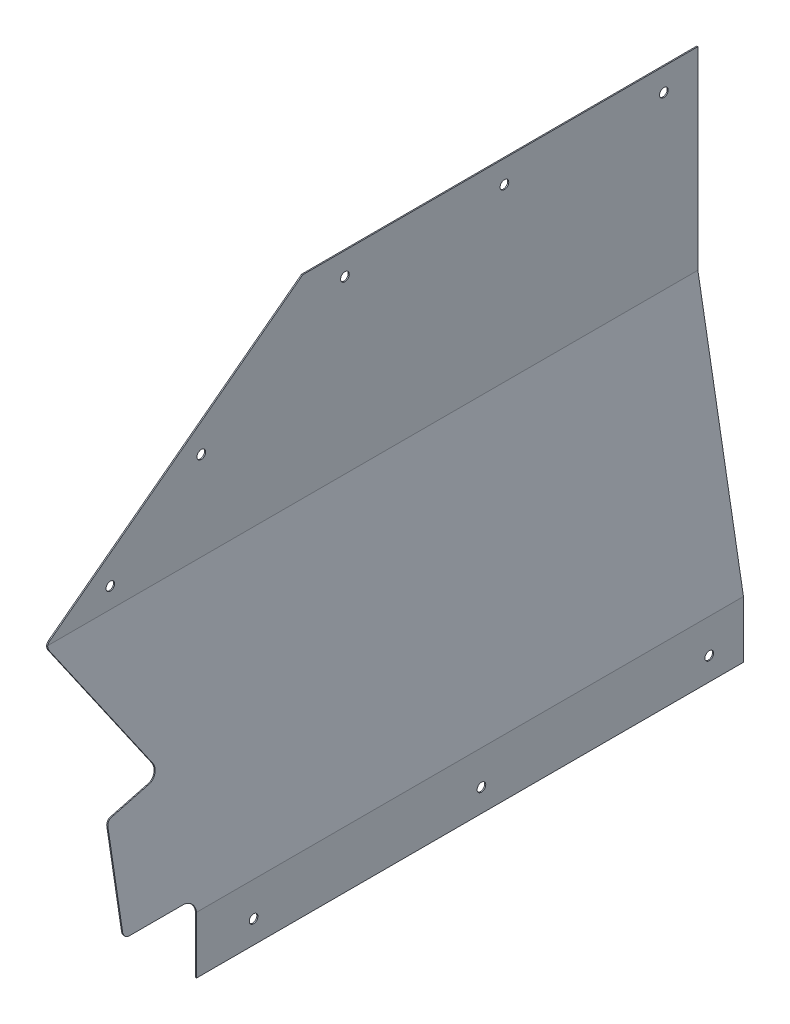
ISO-10303-21;
HEADER;
FILE_DESCRIPTION(('STEP AP214'),'2;1');
FILE_NAME('part.step','',(''),(''),'','','');
FILE_SCHEMA(('AUTOMOTIVE_DESIGN { 1 0 10303 214 1 1 1 1 }'));
ENDSEC;
DATA;
#1=APPLICATION_CONTEXT('core data for automotive mechanical design processes');
#2=APPLICATION_PROTOCOL_DEFINITION('international standard','automotive_design',2000,#1);
#3=PRODUCT_CONTEXT('',#1,'mechanical');
#4=PRODUCT('Part','Part','',(#3));
#5=PRODUCT_RELATED_PRODUCT_CATEGORY('part','',(#4));
#6=PRODUCT_DEFINITION_FORMATION('','',#4);
#7=PRODUCT_DEFINITION_CONTEXT('part definition',#1,'design');
#8=PRODUCT_DEFINITION('design','',#6,#7);
#9=PRODUCT_DEFINITION_SHAPE('','',#8);
#10=(LENGTH_UNIT() NAMED_UNIT(*) SI_UNIT(.MILLI.,.METRE.));
#11=(NAMED_UNIT(*) PLANE_ANGLE_UNIT() SI_UNIT($,.RADIAN.));
#12=(NAMED_UNIT(*) SI_UNIT($,.STERADIAN.) SOLID_ANGLE_UNIT());
#13=UNCERTAINTY_MEASURE_WITH_UNIT(LENGTH_MEASURE(1.E-05),#10,'distance_accuracy_value','');
#14=(GEOMETRIC_REPRESENTATION_CONTEXT(3) GLOBAL_UNCERTAINTY_ASSIGNED_CONTEXT((#13)) GLOBAL_UNIT_ASSIGNED_CONTEXT((#10,
#11,#12)) REPRESENTATION_CONTEXT('',''));
#15=CARTESIAN_POINT('',(0.,0.,0.));
#16=DIRECTION('',(0.,0.,1.));
#17=DIRECTION('',(1.,0.,0.));
#18=AXIS2_PLACEMENT_3D('',#15,#16,#17);
#19=CARTESIAN_POINT('',(266.7,5923.28000062489,3055.84367308646));
#20=DIRECTION('',(0.,-0.798635510047341,-0.601815023151985));
#21=DIRECTION('',(0.,0.601815023151985,-0.798635510047341));
#22=AXIS2_PLACEMENT_3D('',#19,#20,#21);
#23=PLANE('',#22);
#24=DIRECTION('',(0.,0.601815023151988,-0.798635510047338));
#25=VECTOR('',#24,1.);
#26=CARTESIAN_POINT('',(266.700000000003,5874.23441641765,3120.92936163202));
#27=LINE('',#26,#25);
#28=CARTESIAN_POINT('',(266.700000000003,5874.23441641766,3120.92936163202));
#29=VERTEX_POINT('',#28);
#30=CARTESIAN_POINT('',(266.699999999999,5980.43000062489,2980.00306153083));
#31=VERTEX_POINT('',#30);
#32=EDGE_CURVE('E248',#29,#31,#27,.T.);
#33=ORIENTED_EDGE('',*,*,#32,.T.);
#34=DIRECTION('',(1.,0.,0.));
#35=VECTOR('',#34,1.);
#36=CARTESIAN_POINT('',(266.7,5980.43000062489,2980.00306153083));
#37=LINE('',#36,#35);
#38=CARTESIAN_POINT('',(266.090399999999,5980.43000062489,2980.00306153083));
#39=VERTEX_POINT('',#38);
#40=EDGE_CURVE('E258',#31,#39,#37,.F.);
#41=ORIENTED_EDGE('',*,*,#40,.T.);
#42=DIRECTION('',(0.,0.601815023151969,-0.798635510047353));
#43=VECTOR('',#42,1.);
#44=CARTESIAN_POINT('',(266.090400000003,5874.20031726228,3120.97461273959));
#45=LINE('',#44,#43);
#46=CARTESIAN_POINT('',(266.090400000003,5874.20031726227,3120.9746127396));
#47=VERTEX_POINT('',#46);
#48=EDGE_CURVE('E245',#47,#39,#45,.T.);
#49=ORIENTED_EDGE('',*,*,#48,.F.);
#50=DIRECTION('',(-0.995708210528336,-0.0556968651427743,0.0739122364681644));
#51=VECTOR('',#50,1.);
#52=CARTESIAN_POINT('',(273.348331735291,5874.60630371574,3120.43585051889));
#53=LINE('',#52,#51);
#54=EDGE_CURVE('E175',#29,#47,#53,.T.);
#55=ORIENTED_EDGE('',*,*,#54,.F.);
#56=EDGE_LOOP('',(#33,#41,#49,#55));
#57=FACE_BOUND('',#56,.T.);
#58=ADVANCED_FACE('F42',(#57),#23,.F.);
#59=CARTESIAN_POINT('',(266.7,5980.43000062489,2874.06989807406));
#60=DIRECTION('',(0.,-1.,0.));
#61=DIRECTION('',(1.,0.,0.));
#62=AXIS2_PLACEMENT_3D('',#59,#60,#61);
#63=PLANE('',#62);
#64=DIRECTION('',(1.,0.,0.));
#65=VECTOR('',#64,1.);
#66=CARTESIAN_POINT('',(266.7,5980.43000062489,2759.71));
#67=LINE('',#66,#65);
#68=CARTESIAN_POINT('',(266.0904,5980.43000062489,2759.71));
#69=VERTEX_POINT('',#68);
#70=CARTESIAN_POINT('',(266.7,5980.43000062489,2759.71));
#71=VERTEX_POINT('',#70);
#72=EDGE_CURVE('E253',#69,#71,#67,.T.);
#73=ORIENTED_EDGE('',*,*,#72,.F.);
#74=DIRECTION('',(0.,0.,1.));
#75=VECTOR('',#74,1.);
#76=CARTESIAN_POINT('',(266.0904,5980.43000062489,2759.71));
#77=LINE('',#76,#75);
#78=EDGE_CURVE('E241',#39,#69,#77,.F.);
#79=ORIENTED_EDGE('',*,*,#78,.F.);
#80=ORIENTED_EDGE('',*,*,#40,.F.);
#81=DIRECTION('',(0.,0.,1.));
#82=VECTOR('',#81,1.);
#83=CARTESIAN_POINT('',(266.7,5980.43000062489,2759.71));
#84=LINE('',#83,#82);
#85=EDGE_CURVE('E252',#31,#71,#84,.F.);
#86=ORIENTED_EDGE('',*,*,#85,.T.);
#87=EDGE_LOOP('',(#73,#79,#80,#86));
#88=FACE_BOUND('',#87,.T.);
#89=ADVANCED_FACE('F373',(#88),#63,.F.);
#90=CARTESIAN_POINT('',(266.090400000003,5883.74292329504,3087.20831702677));
#91=DIRECTION('',(1.,0.,0.));
#92=DIRECTION('',(0.,1.,0.));
#93=AXIS2_PLACEMENT_3D('',#90,#91,#92);
#94=CYLINDRICAL_SURFACE('',#93,2.41300000000024);
#95=CARTESIAN_POINT('',(266.090400000003,5883.74292329504,3087.20831702677));
#96=DIRECTION('',(1.,0.,0.));
#97=DIRECTION('',(0.,1.,0.));
#98=AXIS2_PLACEMENT_3D('',#95,#96,#97);
#99=CIRCLE('',#98,2.41300000000024);
#100=CARTESIAN_POINT('',(266.090400000003,5886.15592329504,3087.20831702677));
#101=VERTEX_POINT('',#100);
#102=EDGE_CURVE('E244',#101,#101,#99,.T.);
#103=ORIENTED_EDGE('',*,*,#102,.F.);
#104=EDGE_LOOP('',(#103));
#105=FACE_BOUND('',#104,.T.);
#106=CARTESIAN_POINT('',(266.700000000003,5883.74292329504,3087.20831702677));
#107=DIRECTION('',(1.,0.,0.));
#108=DIRECTION('',(0.,1.,0.));
#109=AXIS2_PLACEMENT_3D('',#106,#107,#108);
#110=CIRCLE('',#109,2.41300000000024);
#111=CARTESIAN_POINT('',(266.700000000002,5886.15592329504,3087.20831702677));
#112=VERTEX_POINT('',#111);
#113=EDGE_CURVE('E45',#112,#112,#110,.T.);
#114=ORIENTED_EDGE('',*,*,#113,.T.);
#115=EDGE_LOOP('',(#114));
#116=FACE_BOUND('',#115,.T.);
#117=ADVANCED_FACE('F370',(#105,#116),#94,.F.);
#118=CARTESIAN_POINT('',(266.090400000003,5921.95817726519,3036.49496213877));
#119=DIRECTION('',(1.,0.,0.));
#120=DIRECTION('',(0.,1.,0.));
#121=AXIS2_PLACEMENT_3D('',#118,#119,#120);
#122=CYLINDRICAL_SURFACE('',#121,2.41300000000024);
#123=CARTESIAN_POINT('',(266.0904,5921.95817726519,3036.49496213877));
#124=DIRECTION('',(1.,0.,0.));
#125=DIRECTION('',(0.,1.,0.));
#126=AXIS2_PLACEMENT_3D('',#123,#124,#125);
#127=CIRCLE('',#126,2.41300000000024);
#128=CARTESIAN_POINT('',(266.0904,5924.37117726519,3036.49496213877));
#129=VERTEX_POINT('',#128);
#130=EDGE_CURVE('E558',#129,#129,#127,.T.);
#131=ORIENTED_EDGE('',*,*,#130,.F.);
#132=EDGE_LOOP('',(#131));
#133=FACE_BOUND('',#132,.T.);
#134=CARTESIAN_POINT('',(266.700000000003,5921.95817726519,3036.49496213877));
#135=DIRECTION('',(1.,0.,0.));
#136=DIRECTION('',(0.,1.,0.));
#137=AXIS2_PLACEMENT_3D('',#134,#135,#136);
#138=CIRCLE('',#137,2.41300000000024);
#139=CARTESIAN_POINT('',(266.700000000002,5924.37117726519,3036.49496213877));
#140=VERTEX_POINT('',#139);
#141=EDGE_CURVE('E457',#140,#140,#138,.T.);
#142=ORIENTED_EDGE('',*,*,#141,.T.);
#143=EDGE_LOOP('',(#142));
#144=FACE_BOUND('',#143,.T.);
#145=ADVANCED_FACE('F366',(#133,#144),#122,.F.);
#146=CARTESIAN_POINT('',(266.0904,5967.73000051653,2956.44607591665));
#147=DIRECTION('',(1.,0.,0.));
#148=DIRECTION('',(0.,1.,0.));
#149=AXIS2_PLACEMENT_3D('',#146,#147,#148);
#150=CYLINDRICAL_SURFACE('',#149,2.41300000000024);
#151=CARTESIAN_POINT('',(266.0904,5967.73000051653,2956.44607591665));
#152=DIRECTION('',(1.,0.,0.));
#153=DIRECTION('',(0.,1.,0.));
#154=AXIS2_PLACEMENT_3D('',#151,#152,#153);
#155=CIRCLE('',#154,2.41300000000024);
#156=CARTESIAN_POINT('',(266.0904,5970.14300051653,2956.44607591665));
#157=VERTEX_POINT('',#156);
#158=EDGE_CURVE('E556',#157,#157,#155,.T.);
#159=ORIENTED_EDGE('',*,*,#158,.F.);
#160=EDGE_LOOP('',(#159));
#161=FACE_BOUND('',#160,.T.);
#162=CARTESIAN_POINT('',(266.7,5967.73000051653,2956.44607591665));
#163=DIRECTION('',(1.,0.,0.));
#164=DIRECTION('',(0.,1.,0.));
#165=AXIS2_PLACEMENT_3D('',#162,#163,#164);
#166=CIRCLE('',#165,2.41300000000024);
#167=CARTESIAN_POINT('',(266.7,5970.14300051653,2956.44607591665));
#168=VERTEX_POINT('',#167);
#169=EDGE_CURVE('E234',#168,#168,#166,.T.);
#170=ORIENTED_EDGE('',*,*,#169,.T.);
#171=EDGE_LOOP('',(#170));
#172=FACE_BOUND('',#171,.T.);
#173=ADVANCED_FACE('F362',(#161,#172),#150,.F.);
#174=CARTESIAN_POINT('',(266.0904,5967.73000018003,2778.64607591665));
#175=DIRECTION('',(1.,0.,0.));
#176=DIRECTION('',(0.,1.,0.));
#177=AXIS2_PLACEMENT_3D('',#174,#175,#176);
#178=CYLINDRICAL_SURFACE('',#177,2.41300000000024);
#179=CARTESIAN_POINT('',(266.0904,5967.73000018003,2778.64607591665));
#180=DIRECTION('',(1.,0.,0.));
#181=DIRECTION('',(0.,1.,0.));
#182=AXIS2_PLACEMENT_3D('',#179,#180,#181);
#183=CIRCLE('',#182,2.41300000000024);
#184=CARTESIAN_POINT('',(266.0904,5970.14300018004,2778.64607591665));
#185=VERTEX_POINT('',#184);
#186=EDGE_CURVE('E553',#185,#185,#183,.T.);
#187=ORIENTED_EDGE('',*,*,#186,.F.);
#188=EDGE_LOOP('',(#187));
#189=FACE_BOUND('',#188,.T.);
#190=CARTESIAN_POINT('',(266.7,5967.73000018003,2778.64607591665));
#191=DIRECTION('',(1.,0.,0.));
#192=DIRECTION('',(0.,1.,0.));
#193=AXIS2_PLACEMENT_3D('',#190,#191,#192);
#194=CIRCLE('',#193,2.41300000000024);
#195=CARTESIAN_POINT('',(266.7,5970.14300018004,2778.64607591665));
#196=VERTEX_POINT('',#195);
#197=EDGE_CURVE('E452',#196,#196,#194,.T.);
#198=ORIENTED_EDGE('',*,*,#197,.T.);
#199=EDGE_LOOP('',(#198));
#200=FACE_BOUND('',#199,.T.);
#201=ADVANCED_FACE('F358',(#189,#200),#178,.F.);
#202=CARTESIAN_POINT('',(266.0904,5967.73000034828,2867.54607591665));
#203=DIRECTION('',(1.,0.,0.));
#204=DIRECTION('',(0.,1.,0.));
#205=AXIS2_PLACEMENT_3D('',#202,#203,#204);
#206=CYLINDRICAL_SURFACE('',#205,2.41300000000024);
#207=CARTESIAN_POINT('',(266.0904,5967.73000034828,2867.54607591665));
#208=DIRECTION('',(1.,0.,0.));
#209=DIRECTION('',(0.,1.,0.));
#210=AXIS2_PLACEMENT_3D('',#207,#208,#209);
#211=CIRCLE('',#210,2.41300000000024);
#212=CARTESIAN_POINT('',(266.0904,5970.14300034829,2867.54607591665));
#213=VERTEX_POINT('',#212);
#214=EDGE_CURVE('E268',#213,#213,#211,.T.);
#215=ORIENTED_EDGE('',*,*,#214,.F.);
#216=EDGE_LOOP('',(#215));
#217=FACE_BOUND('',#216,.T.);
#218=CARTESIAN_POINT('',(266.7,5967.73000034828,2867.54607591665));
#219=DIRECTION('',(1.,0.,0.));
#220=DIRECTION('',(0.,1.,0.));
#221=AXIS2_PLACEMENT_3D('',#218,#219,#220);
#222=CIRCLE('',#221,2.41300000000024);
#223=CARTESIAN_POINT('',(266.7,5970.14300034829,2867.54607591665));
#224=VERTEX_POINT('',#223);
#225=EDGE_CURVE('E455',#224,#224,#222,.T.);
#226=ORIENTED_EDGE('',*,*,#225,.T.);
#227=EDGE_LOOP('',(#226));
#228=FACE_BOUND('',#227,.T.);
#229=ADVANCED_FACE('F354',(#217,#228),#206,.F.);
#230=CARTESIAN_POINT('',(266.7,5974.08000062489,2759.71));
#231=DIRECTION('',(-1.,0.,0.));
#232=DIRECTION('',(0.,-1.,0.));
#233=AXIS2_PLACEMENT_3D('',#230,#231,#232);
#234=PLANE('',#233);
#235=ORIENTED_EDGE('',*,*,#169,.F.);
#236=EDGE_LOOP('',(#235));
#237=FACE_BOUND('',#236,.T.);
#238=ORIENTED_EDGE('',*,*,#197,.F.);
#239=EDGE_LOOP('',(#238));
#240=FACE_BOUND('',#239,.T.);
#241=ORIENTED_EDGE('',*,*,#225,.F.);
#242=EDGE_LOOP('',(#241));
#243=FACE_BOUND('',#242,.T.);
#244=ORIENTED_EDGE('',*,*,#141,.F.);
#245=EDGE_LOOP('',(#244));
#246=FACE_BOUND('',#245,.T.);
#247=ORIENTED_EDGE('',*,*,#113,.F.);
#248=EDGE_LOOP('',(#247));
#249=FACE_BOUND('',#248,.T.);
#250=DIRECTION('',(0.,0.,1.));
#251=VECTOR('',#250,1.);
#252=CARTESIAN_POINT('',(266.7,5872.48000062489,2759.71));
#253=LINE('',#252,#251);
#254=CARTESIAN_POINT('',(266.700000000001,5872.48000062488,3122.10149619294));
#255=VERTEX_POINT('',#254);
#256=CARTESIAN_POINT('',(266.7,5872.48000062489,2759.71));
#257=VERTEX_POINT('',#256);
#258=EDGE_CURVE('E148',#255,#257,#253,.F.);
#259=ORIENTED_EDGE('',*,*,#258,.T.);
#260=DIRECTION('',(0.,1.,0.));
#261=VECTOR('',#260,1.);
#262=CARTESIAN_POINT('',(266.7,5715.,2759.71));
#263=LINE('',#262,#261);
#264=EDGE_CURVE('E267',#257,#71,#263,.T.);
#265=ORIENTED_EDGE('',*,*,#264,.T.);
#266=ORIENTED_EDGE('',*,*,#85,.F.);
#267=ORIENTED_EDGE('',*,*,#32,.F.);
#268=CARTESIAN_POINT('',(266.700000000003,5871.69874867326,3119.01859893352));
#269=DIRECTION('',(-1.,0.,0.));
#270=DIRECTION('',(0.,-0.601815023151986,0.79863551004734));
#271=AXIS2_PLACEMENT_3D('',#268,#269,#270);
#272=ELLIPSE('',#271,3.1886851654214,3.175);
#273=EDGE_CURVE('E153',#255,#29,#272,.T.);
#274=ORIENTED_EDGE('',*,*,#273,.F.);
#275=EDGE_LOOP('',(#259,#265,#266,#267,#274));
#276=FACE_BOUND('',#275,.T.);
#277=ADVANCED_FACE('F350',(#237,#240,#243,#246,#249,#276),#234,.F.);
#278=CARTESIAN_POINT('',(292.1,5727.7,2759.71));
#279=DIRECTION('',(-1.,0.,0.));
#280=DIRECTION('',(0.,0.,1.));
#281=AXIS2_PLACEMENT_3D('',#278,#279,#280);
#282=PLANE('',#281);
#283=CARTESIAN_POINT('',(292.1,5708.65,2778.76));
#284=DIRECTION('',(1.,0.,0.));
#285=DIRECTION('',(0.,0.,-1.));
#286=AXIS2_PLACEMENT_3D('',#283,#284,#285);
#287=CIRCLE('',#286,2.4129999999991);
#288=CARTESIAN_POINT('',(292.1,5708.65,2776.347));
#289=VERTEX_POINT('',#288);
#290=EDGE_CURVE('E184',#289,#289,#287,.F.);
#291=ORIENTED_EDGE('',*,*,#290,.T.);
#292=EDGE_LOOP('',(#291));
#293=FACE_BOUND('',#292,.T.);
#294=CARTESIAN_POINT('',(292.1,5708.65,2905.76));
#295=DIRECTION('',(1.,0.,0.));
#296=DIRECTION('',(0.,0.,-1.));
#297=AXIS2_PLACEMENT_3D('',#294,#295,#296);
#298=CIRCLE('',#297,2.4129999999991);
#299=CARTESIAN_POINT('',(292.1,5708.65,2903.347));
#300=VERTEX_POINT('',#299);
#301=EDGE_CURVE('E444',#300,#300,#298,.F.);
#302=ORIENTED_EDGE('',*,*,#301,.T.);
#303=EDGE_LOOP('',(#302));
#304=FACE_BOUND('',#303,.T.);
#305=CARTESIAN_POINT('',(292.1,5708.65,3032.76));
#306=DIRECTION('',(1.,0.,0.));
#307=DIRECTION('',(0.,0.,-1.));
#308=AXIS2_PLACEMENT_3D('',#305,#306,#307);
#309=CIRCLE('',#308,2.4129999999991);
#310=CARTESIAN_POINT('',(292.1,5708.65,3030.347));
#311=VERTEX_POINT('',#310);
#312=EDGE_CURVE('E209',#311,#311,#309,.F.);
#313=ORIENTED_EDGE('',*,*,#312,.T.);
#314=EDGE_LOOP('',(#313));
#315=FACE_BOUND('',#314,.T.);
#316=DIRECTION('',(0.,0.,1.));
#317=VECTOR('',#316,1.);
#318=CARTESIAN_POINT('',(292.1,5695.95,2912.11));
#319=LINE('',#318,#317);
#320=CARTESIAN_POINT('',(292.1,5695.95,3064.51));
#321=VERTEX_POINT('',#320);
#322=CARTESIAN_POINT('',(292.1,5695.95,2759.71));
#323=VERTEX_POINT('',#322);
#324=EDGE_CURVE('E230',#321,#323,#319,.F.);
#325=ORIENTED_EDGE('',*,*,#324,.T.);
#326=DIRECTION('',(0.,1.,0.));
#327=VECTOR('',#326,1.);
#328=CARTESIAN_POINT('',(292.1,5715.,2759.71));
#329=LINE('',#328,#327);
#330=CARTESIAN_POINT('',(292.1,5727.7,2759.71));
#331=VERTEX_POINT('',#330);
#332=EDGE_CURVE('E226',#323,#331,#329,.T.);
#333=ORIENTED_EDGE('',*,*,#332,.T.);
#334=DIRECTION('',(0.,0.,1.));
#335=VECTOR('',#334,1.);
#336=CARTESIAN_POINT('',(292.100000000001,5727.7,2759.71));
#337=LINE('',#336,#335);
#338=CARTESIAN_POINT('',(292.1,5727.7,3064.51));
#339=VERTEX_POINT('',#338);
#340=EDGE_CURVE('E154',#331,#339,#337,.T.);
#341=ORIENTED_EDGE('',*,*,#340,.T.);
#342=DIRECTION('',(0.,1.,0.));
#343=VECTOR('',#342,1.);
#344=CARTESIAN_POINT('',(292.1,5715.,3064.51));
#345=LINE('',#344,#343);
#346=EDGE_CURVE('E214',#339,#321,#345,.F.);
#347=ORIENTED_EDGE('',*,*,#346,.T.);
#348=EDGE_LOOP('',(#325,#333,#341,#347));
#349=FACE_BOUND('',#348,.T.);
#350=ADVANCED_FACE('F346',(#293,#304,#315,#349),#282,.F.);
#351=CARTESIAN_POINT('',(292.1,5695.95,2912.11));
#352=DIRECTION('',(0.,1.,0.));
#353=DIRECTION('',(-1.,0.,0.));
#354=AXIS2_PLACEMENT_3D('',#351,#352,#353);
#355=PLANE('',#354);
#356=DIRECTION('',(-1.,0.,0.));
#357=VECTOR('',#356,1.);
#358=CARTESIAN_POINT('',(292.1,5695.95,3064.51));
#359=LINE('',#358,#357);
#360=CARTESIAN_POINT('',(291.490399999999,5695.95,3064.51));
#361=VERTEX_POINT('',#360);
#362=EDGE_CURVE('E210',#321,#361,#359,.T.);
#363=ORIENTED_EDGE('',*,*,#362,.T.);
#364=DIRECTION('',(0.,0.,1.));
#365=VECTOR('',#364,1.);
#366=CARTESIAN_POINT('',(291.4904,5695.95,2759.71));
#367=LINE('',#366,#365);
#368=CARTESIAN_POINT('',(291.4904,5695.95,2759.71));
#369=VERTEX_POINT('',#368);
#370=EDGE_CURVE('E204',#369,#361,#367,.T.);
#371=ORIENTED_EDGE('',*,*,#370,.F.);
#372=DIRECTION('',(1.,0.,0.));
#373=VECTOR('',#372,1.);
#374=CARTESIAN_POINT('',(292.1,5695.95,2759.71));
#375=LINE('',#374,#373);
#376=EDGE_CURVE('E223',#369,#323,#375,.T.);
#377=ORIENTED_EDGE('',*,*,#376,.T.);
#378=ORIENTED_EDGE('',*,*,#324,.F.);
#379=EDGE_LOOP('',(#363,#371,#377,#378));
#380=FACE_BOUND('',#379,.T.);
#381=ADVANCED_FACE('F342',(#380),#355,.F.);
#382=CARTESIAN_POINT('',(292.1,5715.,3064.51));
#383=DIRECTION('',(0.,0.,-1.));
#384=DIRECTION('',(-1.,0.,0.));
#385=AXIS2_PLACEMENT_3D('',#382,#383,#384);
#386=PLANE('',#385);
#387=DIRECTION('',(0.,1.,0.));
#388=VECTOR('',#387,1.);
#389=CARTESIAN_POINT('',(291.490399999999,5727.7,3064.51));
#390=LINE('',#389,#388);
#391=CARTESIAN_POINT('',(291.490399999999,5727.59305263203,3064.51));
#392=VERTEX_POINT('',#391);
#393=EDGE_CURVE('E199',#361,#392,#390,.T.);
#394=ORIENTED_EDGE('',*,*,#393,.F.);
#395=ORIENTED_EDGE('',*,*,#362,.F.);
#396=ORIENTED_EDGE('',*,*,#346,.F.);
#397=DIRECTION('',(0.984957024770471,0.172799477300427,0.));
#398=VECTOR('',#397,1.);
#399=CARTESIAN_POINT('',(291.4904,5727.59305263203,3064.51));
#400=LINE('',#399,#398);
#401=EDGE_CURVE('E207',#392,#339,#400,.T.);
#402=ORIENTED_EDGE('',*,*,#401,.F.);
#403=EDGE_LOOP('',(#394,#395,#396,#402));
#404=FACE_BOUND('',#403,.T.);
#405=ADVANCED_FACE('F338',(#404),#386,.F.);
#406=CARTESIAN_POINT('',(291.4904,5708.65,3032.76));
#407=DIRECTION('',(1.,0.,0.));
#408=DIRECTION('',(0.,0.,-1.));
#409=AXIS2_PLACEMENT_3D('',#406,#407,#408);
#410=CYLINDRICAL_SURFACE('',#409,2.4129999999991);
#411=CARTESIAN_POINT('',(291.4904,5708.65,3032.76));
#412=DIRECTION('',(1.,0.,0.));
#413=DIRECTION('',(0.,0.,-1.));
#414=AXIS2_PLACEMENT_3D('',#411,#412,#413);
#415=CIRCLE('',#414,2.4129999999991);
#416=CARTESIAN_POINT('',(291.4904,5708.65,3030.347));
#417=VERTEX_POINT('',#416);
#418=EDGE_CURVE('E203',#417,#417,#415,.T.);
#419=ORIENTED_EDGE('',*,*,#418,.F.);
#420=EDGE_LOOP('',(#419));
#421=FACE_BOUND('',#420,.T.);
#422=ORIENTED_EDGE('',*,*,#312,.F.);
#423=EDGE_LOOP('',(#422));
#424=FACE_BOUND('',#423,.T.);
#425=ADVANCED_FACE('F334',(#421,#424),#410,.F.);
#426=CARTESIAN_POINT('',(291.4904,5708.65,2905.76));
#427=DIRECTION('',(1.,0.,0.));
#428=DIRECTION('',(0.,0.,-1.));
#429=AXIS2_PLACEMENT_3D('',#426,#427,#428);
#430=CYLINDRICAL_SURFACE('',#429,2.4129999999991);
#431=CARTESIAN_POINT('',(291.4904,5708.65,2905.76));
#432=DIRECTION('',(1.,0.,0.));
#433=DIRECTION('',(0.,0.,-1.));
#434=AXIS2_PLACEMENT_3D('',#431,#432,#433);
#435=CIRCLE('',#434,2.4129999999991);
#436=CARTESIAN_POINT('',(291.4904,5708.65,2903.347));
#437=VERTEX_POINT('',#436);
#438=EDGE_CURVE('E545',#437,#437,#435,.T.);
#439=ORIENTED_EDGE('',*,*,#438,.F.);
#440=EDGE_LOOP('',(#439));
#441=FACE_BOUND('',#440,.T.);
#442=ORIENTED_EDGE('',*,*,#301,.F.);
#443=EDGE_LOOP('',(#442));
#444=FACE_BOUND('',#443,.T.);
#445=ADVANCED_FACE('F330',(#441,#444),#430,.F.);
#446=CARTESIAN_POINT('',(291.4904,5708.65,2778.76));
#447=DIRECTION('',(1.,0.,0.));
#448=DIRECTION('',(0.,0.,-1.));
#449=AXIS2_PLACEMENT_3D('',#446,#447,#448);
#450=CYLINDRICAL_SURFACE('',#449,2.4129999999991);
#451=CARTESIAN_POINT('',(291.4904,5708.65,2778.76));
#452=DIRECTION('',(1.,0.,0.));
#453=DIRECTION('',(0.,0.,-1.));
#454=AXIS2_PLACEMENT_3D('',#451,#452,#453);
#455=CIRCLE('',#454,2.4129999999991);
#456=CARTESIAN_POINT('',(291.4904,5708.65,2776.347));
#457=VERTEX_POINT('',#456);
#458=EDGE_CURVE('E542',#457,#457,#455,.T.);
#459=ORIENTED_EDGE('',*,*,#458,.F.);
#460=EDGE_LOOP('',(#459));
#461=FACE_BOUND('',#460,.T.);
#462=ORIENTED_EDGE('',*,*,#290,.F.);
#463=EDGE_LOOP('',(#462));
#464=FACE_BOUND('',#463,.T.);
#465=ADVANCED_FACE('F326',(#461,#464),#450,.F.);
#466=CARTESIAN_POINT('',(266.7,5872.48000062489,2759.71));
#467=DIRECTION('',(-0.984957024773253,-0.172799477284575,0.));
#468=DIRECTION('',(0.172799477284575,-0.984957024773253,0.));
#469=AXIS2_PLACEMENT_3D('',#466,#467,#468);
#470=PLANE('',#469);
#471=DIRECTION('',(0.146160865656875,-0.833116937839947,-0.533435253085717));
#472=VECTOR('',#471,1.);
#473=CARTESIAN_POINT('',(267.128392793614,5870.03816169075,3121.69406846455));
#474=LINE('',#473,#472);
#475=CARTESIAN_POINT('',(267.128392793614,5870.03816169075,3121.69406846455));
#476=VERTEX_POINT('',#475);
#477=CARTESIAN_POINT('',(279.530224284907,5799.34772188527,3076.43178782224));
#478=VERTEX_POINT('',#477);
#479=EDGE_CURVE('E145',#476,#478,#474,.T.);
#480=ORIENTED_EDGE('',*,*,#479,.T.);
#481=CARTESIAN_POINT('',(280.888621346353,5791.60485860161,3079.65956040361));
#482=CARTESIAN_POINT('',(280.884848342892,5791.62636472143,3079.55932948785));
#483=CARTESIAN_POINT('',(280.880547676344,5791.65087852086,3079.45979649507));
#484=CARTESIAN_POINT('',(280.870905994527,5791.70583610745,3079.26242308206));
#485=CARTESIAN_POINT('',(280.865564887597,5791.73628041709,3079.16458281178));
#486=CARTESIAN_POINT('',(280.847999139526,5791.83640518152,3078.87398367353));
#487=CARTESIAN_POINT('',(280.834235564544,5791.91485755926,3078.68423910635));
#488=CARTESIAN_POINT('',(280.807596877792,5792.0666980744,3078.37163147867));
#489=CARTESIAN_POINT('',(280.795710638991,5792.13444963586,3078.24588785874));
#490=CARTESIAN_POINT('',(280.770143939367,5792.28017982434,3078.00060474061));
#491=CARTESIAN_POINT('',(280.756463156173,5792.35816028888,3077.88106636252));
#492=CARTESIAN_POINT('',(280.727408992208,5792.5237690242,3077.649035355));
#493=CARTESIAN_POINT('',(280.712035019595,5792.61140066848,3077.53654521092));
#494=CARTESIAN_POINT('',(280.679712440808,5792.79563936835,3077.31941344795));
#495=CARTESIAN_POINT('',(280.66276382592,5792.89224647363,3077.21477187252));
#496=CARTESIAN_POINT('',(280.627391230603,5793.0938702678,3077.01389772218));
#497=CARTESIAN_POINT('',(280.60896516576,5793.19889883787,3076.9176774429));
#498=CARTESIAN_POINT('',(280.570799183101,5793.41644493997,3076.73448274289));
#499=CARTESIAN_POINT('',(280.551059716736,5793.52895989873,3076.64750517162));
#500=CARTESIAN_POINT('',(280.510393854882,5793.7607553123,3076.48329050422));
#501=CARTESIAN_POINT('',(280.489466966219,5793.8800385782,3076.40605749889));
#502=CARTESIAN_POINT('',(280.446589036532,5794.12444277846,3076.26189607133));
#503=CARTESIAN_POINT('',(280.424638355268,5794.24956166219,3076.19496406437));
#504=CARTESIAN_POINT('',(280.379517826569,5794.50674867689,3076.07085838795));
#505=CARTESIAN_POINT('',(280.356334513824,5794.63889356011,3076.01384862612));
#506=CARTESIAN_POINT('',(280.309235311803,5794.9073590128,3075.9112386317));
#507=CARTESIAN_POINT('',(280.285319680024,5795.04367811453,3075.86563443926));
#508=CARTESIAN_POINT('',(280.236908913823,5795.31961948306,3075.78608874138));
#509=CARTESIAN_POINT('',(280.212413618454,5795.45924266727,3075.75215051667));
#510=CARTESIAN_POINT('',(280.163029459495,5795.74073237455,3075.69617909299));
#511=CARTESIAN_POINT('',(280.138140739312,5795.88259808021,3075.67414165459));
#512=CARTESIAN_POINT('',(280.08783079758,5796.16936474932,3075.64189794076));
#513=CARTESIAN_POINT('',(280.062406775534,5796.3142816756,3075.63183783692));
#514=CARTESIAN_POINT('',(280.011511760691,5796.60438326146,3075.62410105523));
#515=CARTESIAN_POINT('',(279.986040788003,5796.74956780641,3075.62641993868));
#516=CARTESIAN_POINT('',(279.935209200436,5797.03930785679,3075.64342026906));
#517=CARTESIAN_POINT('',(279.909848648681,5797.18386300242,3075.65810804001));
#518=CARTESIAN_POINT('',(279.859439736828,5797.47119380122,3075.69975245984));
#519=CARTESIAN_POINT('',(279.834391263429,5797.61397010022,3075.72670451438));
#520=CARTESIAN_POINT('',(279.784906040354,5797.89603587296,3075.79252785405));
#521=CARTESIAN_POINT('',(279.760466754175,5798.03533980478,3075.83133528138));
#522=CARTESIAN_POINT('',(279.712236134426,5798.31025433853,3075.92066591643));
#523=CARTESIAN_POINT('',(279.688444796215,5798.44586496692,3075.9711890402));
#524=CARTESIAN_POINT('',(279.641661452209,5798.71253002891,3076.08367256004));
#525=CARTESIAN_POINT('',(279.618670089486,5798.84358079699,3076.14564191594));
#526=CARTESIAN_POINT('',(279.573669000324,5799.10008700633,3076.28057501204));
#527=CARTESIAN_POINT('',(279.551659373479,5799.22554187989,3076.35353986444));
#528=CARTESIAN_POINT('',(279.530224284909,5799.34772188527,3076.43178782224));
#529=B_SPLINE_CURVE_WITH_KNOTS('',3,(#481,#482,#483,#484,#485,#486,#487,#488,#489,#490,#491,
#492,#493,#494,#495,#496,#497,#498,#499,#500,#501,#502,#503,#504,#505,#506,#507,#508,#509,#510,
#511,#512,#513,#514,#515,#516,#517,#518,#519,#520,#521,#522,#523,#524,#525,#526,#527,#528),
.UNSPECIFIED.,.F.,.F.,(4,2,2,2,2,2,2,2,2,2,2,2,2,2,2,2,2,2,2,2,2,2,2,4),(0.,0.307633417334413,
0.615293949232706,1.23089758657611,1.66043181687526,2.09004331422486,2.51980545848829,
2.94956998152197,3.37995186911374,3.8101865797786,4.2406013073125,4.67086591037817,
5.10767480087287,5.54433182618215,5.98111154900773,6.41773557492036,6.85963526576051,
7.30137651641049,7.74334375981077,8.18514557345013,8.6246084151681,9.06406810822765,
9.50387326879986,9.94372294549397),.UNSPECIFIED.);
#530=CARTESIAN_POINT('',(280.888621346355,5791.60485860161,3079.65956040361));
#531=VERTEX_POINT('',#530);
#532=EDGE_CURVE('E171',#531,#478,#529,.T.);
#533=ORIENTED_EDGE('',*,*,#532,.F.);
#534=DIRECTION('',(0.0367783754794001,-0.20963674113813,0.977087400318969));
#535=VECTOR('',#534,1.);
#536=CARTESIAN_POINT('',(280.888621346357,5791.6048586016,3079.65956040361));
#537=LINE('',#536,#535);
#538=CARTESIAN_POINT('',(281.715074103886,5786.89407786333,3101.61584764618));
#539=VERTEX_POINT('',#538);
#540=EDGE_CURVE('E187',#531,#539,#537,.T.);
#541=ORIENTED_EDGE('',*,*,#540,.T.);
#542=CARTESIAN_POINT('',(282.251141713603,5783.83849247476,3100.94008552015));
#543=DIRECTION('',(-0.984957024773253,-0.172799477284575,0.));
#544=DIRECTION('',(0.172799477284575,-0.984957024773253,0.));
#545=AXIS2_PLACEMENT_3D('',#542,#543,#544);
#546=CIRCLE('',#545,3.175);
#547=CARTESIAN_POINT('',(282.251141713603,5783.83849247476,3104.11508552015));
#548=VERTEX_POINT('',#547);
#549=EDGE_CURVE('E190',#548,#539,#546,.T.);
#550=ORIENTED_EDGE('',*,*,#549,.F.);
#551=DIRECTION('',(0.1727994772846,-0.984957024773248,0.));
#552=VECTOR('',#551,1.);
#553=CARTESIAN_POINT('',(282.251141713603,5783.83849247476,3104.11508552015));
#554=LINE('',#553,#552);
#555=CARTESIAN_POINT('',(290.454084978864,5737.08171566097,3104.11508552015));
#556=VERTEX_POINT('',#555);
#557=EDGE_CURVE('E191',#548,#556,#554,.T.);
#558=ORIENTED_EDGE('',*,*,#557,.T.);
#559=CARTESIAN_POINT('',(290.454084978864,5737.08171566097,3100.94008552015));
#560=DIRECTION('',(-0.984957024773253,-0.172799477284575,0.));
#561=DIRECTION('',(0.172799477284575,-0.984957024773253,0.));
#562=AXIS2_PLACEMENT_3D('',#559,#560,#561);
#563=CIRCLE('',#562,3.175);
#564=CARTESIAN_POINT('',(291.002723319243,5733.95447710731,3100.94008552015));
#565=VERTEX_POINT('',#564);
#566=EDGE_CURVE('E194',#565,#556,#563,.T.);
#567=ORIENTED_EDGE('',*,*,#566,.F.);
#568=DIRECTION('',(0.,0.,1.));
#569=VECTOR('',#568,1.);
#570=CARTESIAN_POINT('',(291.002723319244,5733.9544771073,3084.31254276006));
#571=LINE('',#570,#569);
#572=CARTESIAN_POINT('',(291.002723319244,5733.9544771073,3070.86));
#573=VERTEX_POINT('',#572);
#574=EDGE_CURVE('E195',#565,#573,#571,.F.);
#575=ORIENTED_EDGE('',*,*,#574,.T.);
#576=CARTESIAN_POINT('',(292.100000000002,5727.69999999999,3070.86));
#577=DIRECTION('',(-0.984957024773253,-0.172799477284575,0.));
#578=DIRECTION('',(0.172799477284575,-0.984957024773253,0.));
#579=AXIS2_PLACEMENT_3D('',#576,#577,#578);
#580=CIRCLE('',#579,6.35000000000041);
#581=EDGE_CURVE('E540',#573,#339,#580,.T.);
#582=ORIENTED_EDGE('',*,*,#581,.T.);
#583=ORIENTED_EDGE('',*,*,#340,.F.);
#584=DIRECTION('',(-0.172799477284568,0.984957024773254,0.));
#585=VECTOR('',#584,1.);
#586=CARTESIAN_POINT('',(292.1,5727.7,2759.71));
#587=LINE('',#586,#585);
#588=EDGE_CURVE('E265',#331,#257,#587,.T.);
#589=ORIENTED_EDGE('',*,*,#588,.T.);
#590=ORIENTED_EDGE('',*,*,#258,.F.);
#591=CARTESIAN_POINT('',(266.835729761662,5871.70634098007,3119.00852360208));
#592=DIRECTION('',(-0.984957024773253,-0.172799477284575,0.));
#593=DIRECTION('',(-0.146160865656866,0.833116937839948,0.533435253085718));
#594=AXIS2_PLACEMENT_3D('',#591,#592,#593);
#595=ELLIPSE('',#594,3.20592374488722,3.175);
#596=EDGE_CURVE('E141',#476,#255,#595,.T.);
#597=ORIENTED_EDGE('',*,*,#596,.F.);
#598=EDGE_LOOP('',(#480,#533,#541,#550,#558,#567,#575,#582,#583,#589,#590,#597));
#599=FACE_BOUND('',#598,.T.);
#600=ADVANCED_FACE('F143',(#599),#470,.F.);
#601=CARTESIAN_POINT('',(273.348331735291,5872.07063597133,3118.52508782038));
#602=DIRECTION('',(-0.995708210528336,-0.0556968651427743,0.0739122364681644));
#603=DIRECTION('',(0.0740271469704956,0.,0.997256226609495));
#604=AXIS2_PLACEMENT_3D('',#601,#602,#603);
#605=CYLINDRICAL_SURFACE('',#604,3.175);
#606=ORIENTED_EDGE('',*,*,#54,.T.);
#607=CARTESIAN_POINT('',(266.090400000003,5871.66464951787,3119.0638500411));
#608=DIRECTION('',(-1.,0.,0.));
#609=DIRECTION('',(0.,-0.601815023151986,0.79863551004734));
#610=AXIS2_PLACEMENT_3D('',#607,#608,#609);
#611=ELLIPSE('',#610,3.1886851654214,3.175);
#612=CARTESIAN_POINT('',(266.090400000004,5872.42693219062,3122.1515771035));
#613=VERTEX_POINT('',#612);
#614=EDGE_CURVE('E428',#613,#47,#611,.T.);
#615=ORIENTED_EDGE('',*,*,#614,.F.);
#616=CARTESIAN_POINT('',(266.222834159401,5871.6720574788,3119.05401934491));
#617=DIRECTION('',(-0.984957024773253,-0.172799477284575,0.));
#618=DIRECTION('',(-0.146160865656866,0.833116937839948,0.533435253085718));
#619=AXIS2_PLACEMENT_3D('',#616,#617,#618);
#620=ELLIPSE('',#619,3.20592374488722,3.175);
#621=CARTESIAN_POINT('',(266.515497191354,5870.00387818947,3121.73956420739));
#622=VERTEX_POINT('',#621);
#623=EDGE_CURVE('E160',#622,#613,#620,.T.);
#624=ORIENTED_EDGE('',*,*,#623,.F.);
#625=DIRECTION('',(0.995708210528278,0.0556968651464875,-0.0739122364661521));
#626=VECTOR('',#625,1.);
#627=CARTESIAN_POINT('',(266.515497191352,5870.00387818947,3121.73956420738));
#628=LINE('',#627,#626);
#629=EDGE_CURVE('E157',#622,#476,#628,.T.);
#630=ORIENTED_EDGE('',*,*,#629,.T.);
#631=ORIENTED_EDGE('',*,*,#596,.T.);
#632=ORIENTED_EDGE('',*,*,#273,.T.);
#633=EDGE_LOOP('',(#606,#615,#624,#630,#631,#632));
#634=FACE_BOUND('',#633,.T.);
#635=ADVANCED_FACE('F158',(#634),#605,.T.);
#636=CARTESIAN_POINT('',(266.0904,5974.08000062489,2759.71));
#637=DIRECTION('',(-1.,0.,0.));
#638=DIRECTION('',(0.,-1.,0.));
#639=AXIS2_PLACEMENT_3D('',#636,#637,#638);
#640=PLANE('',#639);
#641=ORIENTED_EDGE('',*,*,#214,.T.);
#642=EDGE_LOOP('',(#641));
#643=FACE_BOUND('',#642,.T.);
#644=ORIENTED_EDGE('',*,*,#186,.T.);
#645=EDGE_LOOP('',(#644));
#646=FACE_BOUND('',#645,.T.);
#647=ORIENTED_EDGE('',*,*,#158,.T.);
#648=EDGE_LOOP('',(#647));
#649=FACE_BOUND('',#648,.T.);
#650=ORIENTED_EDGE('',*,*,#130,.T.);
#651=EDGE_LOOP('',(#650));
#652=FACE_BOUND('',#651,.T.);
#653=ORIENTED_EDGE('',*,*,#102,.T.);
#654=EDGE_LOOP('',(#653));
#655=FACE_BOUND('',#654,.T.);
#656=DIRECTION('',(0.,1.,0.));
#657=VECTOR('',#656,1.);
#658=CARTESIAN_POINT('',(266.0904,5715.,2759.71));
#659=LINE('',#658,#657);
#660=CARTESIAN_POINT('',(266.090400000004,5872.42693219062,2759.71));
#661=VERTEX_POINT('',#660);
#662=EDGE_CURVE('E227',#69,#661,#659,.F.);
#663=ORIENTED_EDGE('',*,*,#662,.T.);
#664=DIRECTION('',(0.,0.,1.));
#665=VECTOR('',#664,1.);
#666=CARTESIAN_POINT('',(266.090400000005,5872.42693219062,2759.71));
#667=LINE('',#666,#665);
#668=EDGE_CURVE('E419',#613,#661,#667,.F.);
#669=ORIENTED_EDGE('',*,*,#668,.F.);
#670=ORIENTED_EDGE('',*,*,#614,.T.);
#671=ORIENTED_EDGE('',*,*,#48,.T.);
#672=ORIENTED_EDGE('',*,*,#78,.T.);
#673=EDGE_LOOP('',(#663,#669,#670,#671,#672));
#674=FACE_BOUND('',#673,.T.);
#675=ADVANCED_FACE('F565',(#643,#646,#649,#652,#655,#674),#640,.T.);
#676=CARTESIAN_POINT('',(292.1,5715.,2759.71));
#677=DIRECTION('',(0.,0.,1.));
#678=DIRECTION('',(1.,0.,0.));
#679=AXIS2_PLACEMENT_3D('',#676,#677,#678);
#680=PLANE('',#679);
#681=ORIENTED_EDGE('',*,*,#376,.F.);
#682=DIRECTION('',(0.,1.,0.));
#683=VECTOR('',#682,1.);
#684=CARTESIAN_POINT('',(291.4904,5727.7,2759.71));
#685=LINE('',#684,#683);
#686=CARTESIAN_POINT('',(291.490400000001,5727.64693156575,2759.71));
#687=VERTEX_POINT('',#686);
#688=EDGE_CURVE('E220',#687,#369,#685,.F.);
#689=ORIENTED_EDGE('',*,*,#688,.F.);
#690=DIRECTION('',(0.172799477284575,-0.984957024773253,0.));
#691=VECTOR('',#690,1.);
#692=CARTESIAN_POINT('',(266.0995701977,5872.37466206353,2759.71));
#693=LINE('',#692,#691);
#694=EDGE_CURVE('E415',#661,#687,#693,.T.);
#695=ORIENTED_EDGE('',*,*,#694,.F.);
#696=ORIENTED_EDGE('',*,*,#662,.F.);
#697=ORIENTED_EDGE('',*,*,#72,.T.);
#698=ORIENTED_EDGE('',*,*,#264,.F.);
#699=ORIENTED_EDGE('',*,*,#588,.F.);
#700=ORIENTED_EDGE('',*,*,#332,.F.);
#701=EDGE_LOOP('',(#681,#689,#695,#696,#697,#698,#699,#700));
#702=FACE_BOUND('',#701,.T.);
#703=ADVANCED_FACE('F481',(#702),#680,.F.);
#704=CARTESIAN_POINT('',(291.4904,5727.7,2759.71));
#705=DIRECTION('',(-1.,0.,0.));
#706=DIRECTION('',(0.,0.,1.));
#707=AXIS2_PLACEMENT_3D('',#704,#705,#706);
#708=PLANE('',#707);
#709=ORIENTED_EDGE('',*,*,#458,.T.);
#710=EDGE_LOOP('',(#709));
#711=FACE_BOUND('',#710,.T.);
#712=ORIENTED_EDGE('',*,*,#438,.T.);
#713=EDGE_LOOP('',(#712));
#714=FACE_BOUND('',#713,.T.);
#715=ORIENTED_EDGE('',*,*,#418,.T.);
#716=EDGE_LOOP('',(#715));
#717=FACE_BOUND('',#716,.T.);
#718=ORIENTED_EDGE('',*,*,#393,.T.);
#719=CARTESIAN_POINT('',(291.490399999999,5727.59305263203,3070.86));
#720=DIRECTION('',(-1.,0.,0.));
#721=DIRECTION('',(0.,-1.,0.));
#722=AXIS2_PLACEMENT_3D('',#719,#720,#721);
#723=ELLIPSE('',#722,6.44698178731427,6.35000000000041);
#724=CARTESIAN_POINT('',(291.4904,5727.64693156575,3064.51022175653));
#725=VERTEX_POINT('',#724);
#726=EDGE_CURVE('E198',#392,#725,#723,.F.);
#727=ORIENTED_EDGE('',*,*,#726,.T.);
#728=DIRECTION('',(0.,0.,1.));
#729=VECTOR('',#728,1.);
#730=CARTESIAN_POINT('',(291.490400000002,5727.64693156575,2759.71));
#731=LINE('',#730,#729);
#732=EDGE_CURVE('E418',#687,#725,#731,.T.);
#733=ORIENTED_EDGE('',*,*,#732,.F.);
#734=ORIENTED_EDGE('',*,*,#688,.T.);
#735=ORIENTED_EDGE('',*,*,#370,.T.);
#736=EDGE_LOOP('',(#718,#727,#733,#734,#735));
#737=FACE_BOUND('',#736,.T.);
#738=ADVANCED_FACE('F508',(#711,#714,#717,#737),#708,.T.);
#739=CARTESIAN_POINT('',(291.019229625167,5727.51039116311,3070.86));
#740=DIRECTION('',(-0.984957024773253,-0.172799477284575,0.));
#741=DIRECTION('',(0.172799477284575,-0.984957024773253,0.));
#742=AXIS2_PLACEMENT_3D('',#739,#740,#741);
#743=CYLINDRICAL_SURFACE('',#742,6.35000000000041);
#744=ORIENTED_EDGE('',*,*,#401,.T.);
#745=ORIENTED_EDGE('',*,*,#581,.F.);
#746=DIRECTION('',(-0.984957024773253,-0.172799477284575,0.));
#747=VECTOR('',#746,1.);
#748=CARTESIAN_POINT('',(291.002723319242,5733.9544771073,3070.86));
#749=LINE('',#748,#747);
#750=CARTESIAN_POINT('',(290.402293516943,5733.84913854595,3070.86));
#751=VERTEX_POINT('',#750);
#752=EDGE_CURVE('E197',#573,#751,#749,.T.);
#753=ORIENTED_EDGE('',*,*,#752,.T.);
#754=CARTESIAN_POINT('',(291.4995701977,5727.59466143863,3070.86));
#755=DIRECTION('',(-0.984957024773253,-0.172799477284575,0.));
#756=DIRECTION('',(0.172799477284575,-0.984957024773253,0.));
#757=AXIS2_PLACEMENT_3D('',#754,#755,#756);
#758=CIRCLE('',#757,6.35000000000041);
#759=EDGE_CURVE('E513',#725,#751,#758,.F.);
#760=ORIENTED_EDGE('',*,*,#759,.F.);
#761=ORIENTED_EDGE('',*,*,#726,.F.);
#762=EDGE_LOOP('',(#744,#745,#753,#760,#761));
#763=FACE_BOUND('',#762,.T.);
#764=ADVANCED_FACE('F577',(#763),#743,.F.);
#765=CARTESIAN_POINT('',(291.002723319242,5733.9544771073,3084.31254276006));
#766=DIRECTION('',(-0.172799477284575,0.984957024773253,0.));
#767=DIRECTION('',(-0.984957024773253,-0.172799477284575,0.));
#768=AXIS2_PLACEMENT_3D('',#765,#766,#767);
#769=PLANE('',#768);
#770=DIRECTION('',(0.,0.,1.));
#771=VECTOR('',#770,1.);
#772=CARTESIAN_POINT('',(290.402293516945,5733.84913854594,2759.71));
#773=LINE('',#772,#771);
#774=CARTESIAN_POINT('',(290.402293516943,5733.84913854595,3100.94008552015));
#775=VERTEX_POINT('',#774);
#776=EDGE_CURVE('E521',#751,#775,#773,.T.);
#777=ORIENTED_EDGE('',*,*,#776,.F.);
#778=ORIENTED_EDGE('',*,*,#752,.F.);
#779=ORIENTED_EDGE('',*,*,#574,.F.);
#780=DIRECTION('',(-0.984957024773253,-0.172799477284575,0.));
#781=VECTOR('',#780,1.);
#782=CARTESIAN_POINT('',(291.002723319243,5733.95447710731,3100.94008552015));
#783=LINE('',#782,#781);
#784=EDGE_CURVE('E407',#775,#565,#783,.F.);
#785=ORIENTED_EDGE('',*,*,#784,.F.);
#786=EDGE_LOOP('',(#777,#778,#779,#785));
#787=FACE_BOUND('',#786,.T.);
#788=ADVANCED_FACE('F581',(#787),#769,.F.);
#789=CARTESIAN_POINT('',(290.454084978865,5737.08171566097,3100.94008552015));
#790=DIRECTION('',(-0.984957024773253,-0.172799477284575,0.));
#791=DIRECTION('',(0.172799477284575,-0.984957024773253,0.));
#792=AXIS2_PLACEMENT_3D('',#789,#790,#791);
#793=CYLINDRICAL_SURFACE('',#792,3.175);
#794=ORIENTED_EDGE('',*,*,#566,.T.);
#795=DIRECTION('',(-0.984957024771922,-0.17279947729216,0.));
#796=VECTOR('',#795,1.);
#797=CARTESIAN_POINT('',(290.454084978865,5737.08171566097,3104.11508552015));
#798=LINE('',#797,#796);
#799=CARTESIAN_POINT('',(289.853655176564,5736.97637709961,3104.11508552015));
#800=VERTEX_POINT('',#799);
#801=EDGE_CURVE('E193',#556,#800,#798,.T.);
#802=ORIENTED_EDGE('',*,*,#801,.T.);
#803=CARTESIAN_POINT('',(289.853655176564,5736.97637709961,3100.94008552015));
#804=DIRECTION('',(-0.984957024773253,-0.172799477284575,0.));
#805=DIRECTION('',(0.172799477284575,-0.984957024773253,0.));
#806=AXIS2_PLACEMENT_3D('',#803,#804,#805);
#807=CIRCLE('',#806,3.175);
#808=EDGE_CURVE('E524',#775,#800,#807,.T.);
#809=ORIENTED_EDGE('',*,*,#808,.F.);
#810=ORIENTED_EDGE('',*,*,#784,.T.);
#811=EDGE_LOOP('',(#794,#802,#809,#810));
#812=FACE_BOUND('',#811,.T.);
#813=ADVANCED_FACE('F537',(#812),#793,.T.);
#814=CARTESIAN_POINT('',(286.954573739202,5757.02892981314,3104.11508552015));
#815=DIRECTION('',(0.,0.,-1.));
#816=DIRECTION('',(-1.,0.,0.));
#817=AXIS2_PLACEMENT_3D('',#814,#815,#816);
#818=PLANE('',#817);
#819=DIRECTION('',(0.172799477284575,-0.984957024773253,0.));
#820=VECTOR('',#819,1.);
#821=CARTESIAN_POINT('',(266.099570197699,5872.37466206353,3104.11508552015));
#822=LINE('',#821,#820);
#823=CARTESIAN_POINT('',(281.650711911304,5783.7331539134,3104.11508552015));
#824=VERTEX_POINT('',#823);
#825=EDGE_CURVE('E525',#800,#824,#822,.F.);
#826=ORIENTED_EDGE('',*,*,#825,.F.);
#827=ORIENTED_EDGE('',*,*,#801,.F.);
#828=ORIENTED_EDGE('',*,*,#557,.F.);
#829=DIRECTION('',(-0.984957024773253,-0.172799477284575,0.));
#830=VECTOR('',#829,1.);
#831=CARTESIAN_POINT('',(282.251141713604,5783.83849247475,3104.11508552015));
#832=LINE('',#831,#830);
#833=EDGE_CURVE('E399',#824,#548,#832,.F.);
#834=ORIENTED_EDGE('',*,*,#833,.F.);
#835=EDGE_LOOP('',(#826,#827,#828,#834));
#836=FACE_BOUND('',#835,.T.);
#837=ADVANCED_FACE('F533',(#836),#818,.F.);
#838=CARTESIAN_POINT('',(282.251141713603,5783.83849247476,3100.94008552015));
#839=DIRECTION('',(-0.984957024773253,-0.172799477284575,0.));
#840=DIRECTION('',(0.172799477284575,-0.984957024773253,0.));
#841=AXIS2_PLACEMENT_3D('',#838,#839,#840);
#842=CYLINDRICAL_SURFACE('',#841,3.175);
#843=ORIENTED_EDGE('',*,*,#549,.T.);
#844=DIRECTION('',(-0.984957024773353,-0.172799477284005,-8.01342078145055E-12));
#845=VECTOR('',#844,1.);
#846=CARTESIAN_POINT('',(281.715074103886,5786.89407786334,3101.61584764617));
#847=LINE('',#846,#845);
#848=CARTESIAN_POINT('',(281.114644301587,5786.78873930198,3101.61584764618));
#849=VERTEX_POINT('',#848);
#850=EDGE_CURVE('E189',#539,#849,#847,.T.);
#851=ORIENTED_EDGE('',*,*,#850,.T.);
#852=CARTESIAN_POINT('',(281.650711911305,5783.73315391341,3100.94008552015));
#853=DIRECTION('',(-0.984957024773253,-0.172799477284575,0.));
#854=DIRECTION('',(0.172799477284575,-0.984957024773253,0.));
#855=AXIS2_PLACEMENT_3D('',#852,#853,#854);
#856=CIRCLE('',#855,3.175);
#857=EDGE_CURVE('E293',#824,#849,#856,.T.);
#858=ORIENTED_EDGE('',*,*,#857,.F.);
#859=ORIENTED_EDGE('',*,*,#833,.T.);
#860=EDGE_LOOP('',(#843,#851,#858,#859));
#861=FACE_BOUND('',#860,.T.);
#862=ADVANCED_FACE('F397',(#861),#842,.T.);
#863=CARTESIAN_POINT('',(281.348884412378,5788.98135911395,3091.88732296188));
#864=DIRECTION('',(0.168840192036462,-0.962389098761596,-0.212838464892826));
#865=DIRECTION('',(0.,0.215938600505535,-0.976406944266432));
#866=AXIS2_PLACEMENT_3D('',#863,#864,#865);
#867=PLANE('',#866);
#868=ORIENTED_EDGE('',*,*,#540,.F.);
#869=DIRECTION('',(0.984957024772044,0.172799477291463,0.));
#870=VECTOR('',#869,1.);
#871=CARTESIAN_POINT('',(280.588406445204,5791.55218932093,3079.65956040361));
#872=LINE('',#871,#870);
#873=CARTESIAN_POINT('',(280.288191544053,5791.49952004025,3079.65956040361));
#874=VERTEX_POINT('',#873);
#875=EDGE_CURVE('E166',#874,#531,#872,.T.);
#876=ORIENTED_EDGE('',*,*,#875,.F.);
#877=DIRECTION('',(-0.0367783754795173,0.209636741138061,-0.977087400318979));
#878=VECTOR('',#877,1.);
#879=CARTESIAN_POINT('',(281.114644301584,5786.78873930199,3101.61584764617));
#880=LINE('',#879,#878);
#881=EDGE_CURVE('E292',#849,#874,#880,.T.);
#882=ORIENTED_EDGE('',*,*,#881,.F.);
#883=ORIENTED_EDGE('',*,*,#850,.F.);
#884=EDGE_LOOP('',(#868,#876,#882,#883));
#885=FACE_BOUND('',#884,.T.);
#886=ADVANCED_FACE('F304',(#885),#867,.F.);
#887=CARTESIAN_POINT('',(279.530224284908,5799.34772188527,3076.43178782224));
#888=CARTESIAN_POINT('',(279.924980994522,5797.09760863077,3074.99106602332));
#889=CARTESIAN_POINT('',(280.357635077324,5794.63148034813,3076.01912256535));
#890=CARTESIAN_POINT('',(280.790289160127,5792.16535206551,3077.04717910738));
#891=CARTESIAN_POINT('',(280.888621346356,5791.60485860161,3079.65956040361));
#892=CARTESIAN_POINT('',(278.929794482605,5799.24238332391,3076.43178782224));
#893=CARTESIAN_POINT('',(279.324551192219,5796.99227006941,3074.99106602332));
#894=CARTESIAN_POINT('',(279.757205275022,5794.52614178679,3076.01912256535));
#895=CARTESIAN_POINT('',(280.189859357827,5792.06001350415,3077.04717910738));
#896=CARTESIAN_POINT('',(280.288191544053,5791.49952004025,3079.65956040361));
#897=(BOUNDED_SURFACE() B_SPLINE_SURFACE(1,2,((#887,#888,#889,#890,#891),(#892,#893,#894,#895,
#896)),.UNSPECIFIED.,.F.,.F.,.F.) B_SPLINE_SURFACE_WITH_KNOTS((2,2),(3,2,3),(0.,
0.117635680764406),(-2.14031420899167,-1.1758313969367,-0.211348584881743),
.UNSPECIFIED.) GEOMETRIC_REPRESENTATION_ITEM() RATIONAL_B_SPLINE_SURFACE(((1.,0.885957660932114,
1.,0.885957660932114,1.),(1.,0.885957660932114,1.,0.885957660932114,1.))) REPRESENTATION_ITEM('') SURFACE());
#898=CARTESIAN_POINT('',(280.288191544053,5791.49952004025,3079.65956040361));
#899=CARTESIAN_POINT('',(280.284418540592,5791.52102616007,3079.55932948785));
#900=CARTESIAN_POINT('',(280.280117874044,5791.5455399595,3079.45979649507));
#901=CARTESIAN_POINT('',(280.270476192227,5791.60049754609,3079.26242308206));
#902=CARTESIAN_POINT('',(280.265135085296,5791.63094185573,3079.16458281178));
#903=CARTESIAN_POINT('',(280.247569337225,5791.73106662017,3078.87398367353));
#904=CARTESIAN_POINT('',(280.233805762244,5791.8095189979,3078.68423910635));
#905=CARTESIAN_POINT('',(280.207167075491,5791.96135951305,3078.37163147867));
#906=CARTESIAN_POINT('',(280.195280836691,5792.0291110745,3078.24588785874));
#907=CARTESIAN_POINT('',(280.169714137067,5792.17484126299,3078.00060474062));
#908=CARTESIAN_POINT('',(280.156033353873,5792.25282172753,3077.88106636252));
#909=CARTESIAN_POINT('',(280.126979189907,5792.41843046285,3077.649035355));
#910=CARTESIAN_POINT('',(280.111605217294,5792.50606210712,3077.53654521093));
#911=CARTESIAN_POINT('',(280.079282638508,5792.69030080699,3077.31941344796));
#912=CARTESIAN_POINT('',(280.062334023621,5792.78690791227,3077.21477187253));
#913=CARTESIAN_POINT('',(280.026961428304,5792.98853170645,3077.01389772219));
#914=CARTESIAN_POINT('',(280.00853536346,5793.09356027651,3076.91767744291));
#915=CARTESIAN_POINT('',(279.9703693808,5793.31110637861,3076.7344827429));
#916=CARTESIAN_POINT('',(279.950629914436,5793.42362133737,3076.64750517163));
#917=CARTESIAN_POINT('',(279.909964052582,5793.65541675094,3076.48329050423));
#918=CARTESIAN_POINT('',(279.889037163918,5793.77470001684,3076.4060574989));
#919=CARTESIAN_POINT('',(279.846159234233,5794.0191042171,3076.26189607135));
#920=CARTESIAN_POINT('',(279.824208552972,5794.14422310083,3076.19496406438));
#921=CARTESIAN_POINT('',(279.779088024273,5794.40141011552,3076.07085838796));
#922=CARTESIAN_POINT('',(279.755904711525,5794.53355499875,3076.01384862613));
#923=CARTESIAN_POINT('',(279.708805509502,5794.80202045144,3075.91123863171));
#924=CARTESIAN_POINT('',(279.684889877723,5794.93833955317,3075.86563443927));
#925=CARTESIAN_POINT('',(279.636479111523,5795.2142809217,3075.78608874138));
#926=CARTESIAN_POINT('',(279.611983816154,5795.35390410591,3075.75215051668));
#927=CARTESIAN_POINT('',(279.562599657194,5795.6353938132,3075.69617909299));
#928=CARTESIAN_POINT('',(279.53771093701,5795.77725951886,3075.67414165459));
#929=CARTESIAN_POINT('',(279.487400995278,5796.06402618797,3075.64189794076));
#930=CARTESIAN_POINT('',(279.461976973232,5796.20894311425,3075.63183783692));
#931=CARTESIAN_POINT('',(279.411081958389,5796.49904470011,3075.62410105523));
#932=CARTESIAN_POINT('',(279.385610985701,5796.64422924506,3075.62641993868));
#933=CARTESIAN_POINT('',(279.334779398133,5796.93396929545,3075.64342026906));
#934=CARTESIAN_POINT('',(279.309418846378,5797.07852444108,3075.65810804001));
#935=CARTESIAN_POINT('',(279.259009934524,5797.36585523988,3075.69975245985));
#936=CARTESIAN_POINT('',(279.233961461124,5797.50863153888,3075.72670451438));
#937=CARTESIAN_POINT('',(279.18447623805,5797.79069731163,3075.79252785405));
#938=CARTESIAN_POINT('',(279.160036951871,5797.93000124344,3075.83133528138));
#939=CARTESIAN_POINT('',(279.111806332123,5798.20491577719,3075.92066591643));
#940=CARTESIAN_POINT('',(279.088014993913,5798.34052640558,3075.9711890402));
#941=CARTESIAN_POINT('',(279.041231649907,5798.60719146756,3076.08367256004));
#942=CARTESIAN_POINT('',(279.018240287185,5798.73824223564,3076.14564191594));
#943=CARTESIAN_POINT('',(278.973239198023,5798.99474844497,3076.28057501204));
#944=CARTESIAN_POINT('',(278.951229571178,5799.12020331853,3076.35353986444));
#945=CARTESIAN_POINT('',(278.929794482606,5799.24238332391,3076.43178782224));
#946=B_SPLINE_CURVE_WITH_KNOTS('',3,(#898,#899,#900,#901,#902,#903,#904,#905,#906,#907,#908,
#909,#910,#911,#912,#913,#914,#915,#916,#917,#918,#919,#920,#921,#922,#923,#924,#925,#926,#927,
#928,#929,#930,#931,#932,#933,#934,#935,#936,#937,#938,#939,#940,#941,#942,#943,#944,#945),
.UNSPECIFIED.,.F.,.F.,(4,2,2,2,2,2,2,2,2,2,2,2,2,2,2,2,2,2,2,2,2,2,2,4),(0.,0.307633417334217,
0.615293949232202,1.23089758657634,1.66043181687232,2.09004331421982,2.5198054584815,
2.94956998151246,3.37995186910252,3.81018657976585,4.24060130729927,4.67086591036287,
5.10767480085994,5.54433182617231,5.98111154900115,6.4177355749169,6.85963526576246,
7.30137651641609,7.74334375981905,8.18514557346457,8.62460841517864,9.06406810823387,
9.50387326880102,9.94372294548816),.UNSPECIFIED.);
#947=CARTESIAN_POINT('',(278.929794482606,5799.24238332391,3076.43178782224));
#948=VERTEX_POINT('',#947);
#949=EDGE_CURVE('E52',#874,#948,#946,.T.);
#950=DIRECTION('',(-0.984957024772303,-0.172799477289987,-3.64246399154098E-12));
#951=VECTOR('',#950,1.);
#952=CARTESIAN_POINT('',(279.530224284908,5799.34772188527,3076.43178782224));
#953=LINE('',#952,#951);
#954=EDGE_CURVE('E61',#478,#948,#953,.T.);
#955=ORIENTED_EDGE('',*,*,#949,.F.);
#956=ORIENTED_EDGE('',*,*,#875,.T.);
#957=ORIENTED_EDGE('',*,*,#532,.T.);
#958=ORIENTED_EDGE('',*,*,#954,.T.);
#959=EDGE_LOOP('',(#955,#956,#957,#958));
#960=FACE_BOUND('',#959,.T.);
#961=ADVANCED_FACE('F298',(#960),#897,.T.);
#962=CARTESIAN_POINT('',(273.115112142453,5835.91386125508,3099.84466892351));
#963=DIRECTION('',(-0.092177332898375,0.525410799788475,-0.845840901568006));
#964=DIRECTION('',(0.,0.849457375492926,0.527657244071063));
#965=AXIS2_PLACEMENT_3D('',#962,#963,#964);
#966=PLANE('',#965);
#967=DIRECTION('',(-0.146160865656857,0.833116937839895,0.533435253085803));
#968=VECTOR('',#967,1.);
#969=CARTESIAN_POINT('',(278.929794482607,5799.24238332391,3076.43178782224));
#970=LINE('',#969,#968);
#971=EDGE_CURVE('E11',#948,#622,#970,.T.);
#972=ORIENTED_EDGE('',*,*,#971,.F.);
#973=ORIENTED_EDGE('',*,*,#954,.F.);
#974=ORIENTED_EDGE('',*,*,#479,.F.);
#975=ORIENTED_EDGE('',*,*,#629,.F.);
#976=EDGE_LOOP('',(#972,#973,#974,#975));
#977=FACE_BOUND('',#976,.T.);
#978=ADVANCED_FACE('F164',(#977),#966,.F.);
#979=CARTESIAN_POINT('',(266.0995701977,5872.37466206353,2759.71));
#980=DIRECTION('',(-0.984957024773253,-0.172799477284575,0.));
#981=DIRECTION('',(0.172799477284575,-0.984957024773253,0.));
#982=AXIS2_PLACEMENT_3D('',#979,#980,#981);
#983=PLANE('',#982);
#984=ORIENTED_EDGE('',*,*,#949,.T.);
#985=ORIENTED_EDGE('',*,*,#971,.T.);
#986=ORIENTED_EDGE('',*,*,#623,.T.);
#987=ORIENTED_EDGE('',*,*,#668,.T.);
#988=ORIENTED_EDGE('',*,*,#694,.T.);
#989=ORIENTED_EDGE('',*,*,#732,.T.);
#990=ORIENTED_EDGE('',*,*,#759,.T.);
#991=ORIENTED_EDGE('',*,*,#776,.T.);
#992=ORIENTED_EDGE('',*,*,#808,.T.);
#993=ORIENTED_EDGE('',*,*,#825,.T.);
#994=ORIENTED_EDGE('',*,*,#857,.T.);
#995=ORIENTED_EDGE('',*,*,#881,.T.);
#996=EDGE_LOOP('',(#984,#985,#986,#987,#988,#989,#990,#991,#992,#993,#994,#995));
#997=FACE_BOUND('',#996,.T.);
#998=ADVANCED_FACE('F295',(#997),#983,.T.);
#999=CLOSED_SHELL('',(#58,#89,#117,#145,#173,#201,#229,#277,#350,#381,#405,#425,#445,#465,#600,
#635,#675,#703,#738,#764,#788,#813,#837,#862,#886,#961,#978,#998));
#1000=MANIFOLD_SOLID_BREP('B2',#999);
#1001=ADVANCED_BREP_SHAPE_REPRESENTATION('',(#18,#1000),#14);
#1002=SHAPE_DEFINITION_REPRESENTATION(#9,#1001);
ENDSEC;
END-ISO-10303-21;
